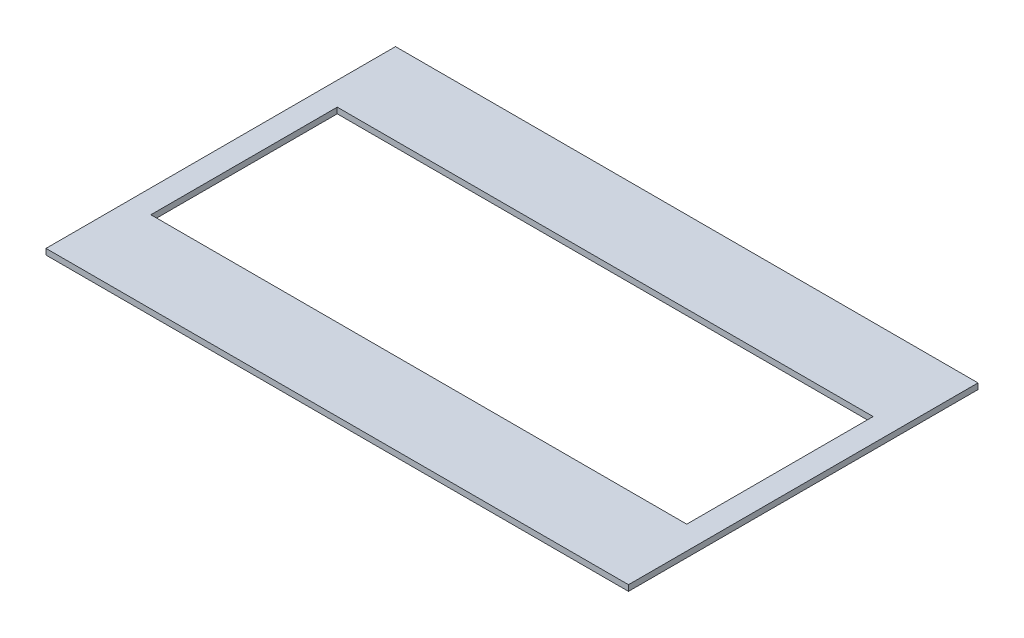
ISO-10303-21;
HEADER;
FILE_DESCRIPTION(('STEP AP214'),'2;1');
FILE_NAME('part.step','',(''),(''),'','','');
FILE_SCHEMA(('AUTOMOTIVE_DESIGN { 1 0 10303 214 1 1 1 1 }'));
ENDSEC;
DATA;
#1=APPLICATION_CONTEXT('core data for automotive mechanical design processes');
#2=APPLICATION_PROTOCOL_DEFINITION('international standard','automotive_design',2000,#1);
#3=PRODUCT_CONTEXT('',#1,'mechanical');
#4=PRODUCT('Part','Part','',(#3));
#5=PRODUCT_RELATED_PRODUCT_CATEGORY('part','',(#4));
#6=PRODUCT_DEFINITION_FORMATION('','',#4);
#7=PRODUCT_DEFINITION_CONTEXT('part definition',#1,'design');
#8=PRODUCT_DEFINITION('design','',#6,#7);
#9=PRODUCT_DEFINITION_SHAPE('','',#8);
#10=(LENGTH_UNIT() NAMED_UNIT(*) SI_UNIT(.MILLI.,.METRE.));
#11=(NAMED_UNIT(*) PLANE_ANGLE_UNIT() SI_UNIT($,.RADIAN.));
#12=(NAMED_UNIT(*) SI_UNIT($,.STERADIAN.) SOLID_ANGLE_UNIT());
#13=UNCERTAINTY_MEASURE_WITH_UNIT(LENGTH_MEASURE(1.E-05),#10,'distance_accuracy_value','');
#14=(GEOMETRIC_REPRESENTATION_CONTEXT(3) GLOBAL_UNCERTAINTY_ASSIGNED_CONTEXT((#13)) GLOBAL_UNIT_ASSIGNED_CONTEXT((#10,
#11,#12)) REPRESENTATION_CONTEXT('',''));
#15=CARTESIAN_POINT('',(0.,0.,0.));
#16=DIRECTION('',(0.,0.,1.));
#17=DIRECTION('',(1.,0.,0.));
#18=AXIS2_PLACEMENT_3D('',#15,#16,#17);
#19=CARTESIAN_POINT('',(-250.,5.,150.));
#20=DIRECTION('',(0.,0.,-1.));
#21=DIRECTION('',(-1.,0.,0.));
#22=AXIS2_PLACEMENT_3D('',#19,#20,#21);
#23=PLANE('',#22);
#24=DIRECTION('',(1.,0.,0.));
#25=VECTOR('',#24,1.);
#26=CARTESIAN_POINT('',(-250.,0.,150.));
#27=LINE('',#26,#25);
#28=CARTESIAN_POINT('',(-250.,0.,150.));
#29=VERTEX_POINT('',#28);
#30=CARTESIAN_POINT('',(250.,0.,150.));
#31=VERTEX_POINT('',#30);
#32=EDGE_CURVE('E133',#29,#31,#27,.T.);
#33=ORIENTED_EDGE('',*,*,#32,.T.);
#34=DIRECTION('',(0.,-1.,0.));
#35=VECTOR('',#34,1.);
#36=CARTESIAN_POINT('',(250.,5.,150.));
#37=LINE('',#36,#35);
#38=CARTESIAN_POINT('',(250.,5.,150.));
#39=VERTEX_POINT('',#38);
#40=EDGE_CURVE('E176',#39,#31,#37,.T.);
#41=ORIENTED_EDGE('',*,*,#40,.F.);
#42=DIRECTION('',(1.,0.,0.));
#43=VECTOR('',#42,1.);
#44=CARTESIAN_POINT('',(-250.,5.,150.));
#45=LINE('',#44,#43);
#46=CARTESIAN_POINT('',(-250.,5.,150.));
#47=VERTEX_POINT('',#46);
#48=EDGE_CURVE('E138',#47,#39,#45,.T.);
#49=ORIENTED_EDGE('',*,*,#48,.F.);
#50=DIRECTION('',(0.,-1.,0.));
#51=VECTOR('',#50,1.);
#52=CARTESIAN_POINT('',(-250.,5.,150.));
#53=LINE('',#52,#51);
#54=EDGE_CURVE('E153',#47,#29,#53,.T.);
#55=ORIENTED_EDGE('',*,*,#54,.T.);
#56=EDGE_LOOP('',(#33,#41,#49,#55));
#57=FACE_BOUND('',#56,.T.);
#58=ADVANCED_FACE('F38',(#57),#23,.F.);
#59=CARTESIAN_POINT('',(250.,5.,-150.));
#60=DIRECTION('',(1.,0.,0.));
#61=DIRECTION('',(0.,0.,-1.));
#62=AXIS2_PLACEMENT_3D('',#59,#60,#61);
#63=PLANE('',#62);
#64=DIRECTION('',(0.,0.,1.));
#65=VECTOR('',#64,1.);
#66=CARTESIAN_POINT('',(250.,0.,-150.));
#67=LINE('',#66,#65);
#68=CARTESIAN_POINT('',(250.,0.,-150.));
#69=VERTEX_POINT('',#68);
#70=EDGE_CURVE('E157',#69,#31,#67,.T.);
#71=ORIENTED_EDGE('',*,*,#70,.F.);
#72=DIRECTION('',(0.,-1.,0.));
#73=VECTOR('',#72,1.);
#74=CARTESIAN_POINT('',(250.,5.,-150.));
#75=LINE('',#74,#73);
#76=CARTESIAN_POINT('',(250.,5.,-150.));
#77=VERTEX_POINT('',#76);
#78=EDGE_CURVE('E173',#77,#69,#75,.T.);
#79=ORIENTED_EDGE('',*,*,#78,.F.);
#80=DIRECTION('',(0.,0.,1.));
#81=VECTOR('',#80,1.);
#82=CARTESIAN_POINT('',(250.,5.,-150.));
#83=LINE('',#82,#81);
#84=EDGE_CURVE('E141',#77,#39,#83,.T.);
#85=ORIENTED_EDGE('',*,*,#84,.T.);
#86=ORIENTED_EDGE('',*,*,#40,.T.);
#87=EDGE_LOOP('',(#71,#79,#85,#86));
#88=FACE_BOUND('',#87,.T.);
#89=ADVANCED_FACE('F206',(#88),#63,.T.);
#90=CARTESIAN_POINT('',(-250.,5.,-150.));
#91=DIRECTION('',(0.,0.,-1.));
#92=DIRECTION('',(-1.,0.,0.));
#93=AXIS2_PLACEMENT_3D('',#90,#91,#92);
#94=PLANE('',#93);
#95=DIRECTION('',(1.,0.,0.));
#96=VECTOR('',#95,1.);
#97=CARTESIAN_POINT('',(-250.,0.,-150.));
#98=LINE('',#97,#96);
#99=CARTESIAN_POINT('',(-250.,0.,-150.));
#100=VERTEX_POINT('',#99);
#101=EDGE_CURVE('E161',#100,#69,#98,.T.);
#102=ORIENTED_EDGE('',*,*,#101,.F.);
#103=DIRECTION('',(0.,-1.,0.));
#104=VECTOR('',#103,1.);
#105=CARTESIAN_POINT('',(-250.,5.,-150.));
#106=LINE('',#105,#104);
#107=CARTESIAN_POINT('',(-250.,5.,-150.));
#108=VERTEX_POINT('',#107);
#109=EDGE_CURVE('E170',#108,#100,#106,.T.);
#110=ORIENTED_EDGE('',*,*,#109,.F.);
#111=DIRECTION('',(1.,0.,0.));
#112=VECTOR('',#111,1.);
#113=CARTESIAN_POINT('',(-250.,5.,-150.));
#114=LINE('',#113,#112);
#115=EDGE_CURVE('E146',#108,#77,#114,.T.);
#116=ORIENTED_EDGE('',*,*,#115,.T.);
#117=ORIENTED_EDGE('',*,*,#78,.T.);
#118=EDGE_LOOP('',(#102,#110,#116,#117));
#119=FACE_BOUND('',#118,.T.);
#120=ADVANCED_FACE('F211',(#119),#94,.T.);
#121=CARTESIAN_POINT('',(-250.,5.,-150.));
#122=DIRECTION('',(1.,0.,0.));
#123=DIRECTION('',(0.,0.,-1.));
#124=AXIS2_PLACEMENT_3D('',#121,#122,#123);
#125=PLANE('',#124);
#126=DIRECTION('',(0.,0.,1.));
#127=VECTOR('',#126,1.);
#128=CARTESIAN_POINT('',(-250.,0.,-150.));
#129=LINE('',#128,#127);
#130=EDGE_CURVE('E142',#100,#29,#129,.T.);
#131=ORIENTED_EDGE('',*,*,#130,.T.);
#132=ORIENTED_EDGE('',*,*,#54,.F.);
#133=DIRECTION('',(0.,0.,1.));
#134=VECTOR('',#133,1.);
#135=CARTESIAN_POINT('',(-250.,5.,-150.));
#136=LINE('',#135,#134);
#137=EDGE_CURVE('E150',#108,#47,#136,.T.);
#138=ORIENTED_EDGE('',*,*,#137,.F.);
#139=ORIENTED_EDGE('',*,*,#109,.T.);
#140=EDGE_LOOP('',(#131,#132,#138,#139));
#141=FACE_BOUND('',#140,.T.);
#142=ADVANCED_FACE('F225',(#141),#125,.F.);
#143=CARTESIAN_POINT('',(0.,5.,0.));
#144=DIRECTION('',(0.,-1.,0.));
#145=DIRECTION('',(0.,0.,-1.));
#146=AXIS2_PLACEMENT_3D('',#143,#144,#145);
#147=PLANE('',#146);
#148=DIRECTION('',(-1.,0.,0.));
#149=VECTOR('',#148,1.);
#150=CARTESIAN_POINT('',(-230.,5.,-80.));
#151=LINE('',#150,#149);
#152=CARTESIAN_POINT('',(230.,5.,-80.));
#153=VERTEX_POINT('',#152);
#154=CARTESIAN_POINT('',(-230.,5.,-80.));
#155=VERTEX_POINT('',#154);
#156=EDGE_CURVE('E115',#153,#155,#151,.T.);
#157=ORIENTED_EDGE('',*,*,#156,.F.);
#158=DIRECTION('',(0.,0.,-1.));
#159=VECTOR('',#158,1.);
#160=CARTESIAN_POINT('',(230.,5.,-80.));
#161=LINE('',#160,#159);
#162=CARTESIAN_POINT('',(230.,5.,80.));
#163=VERTEX_POINT('',#162);
#164=EDGE_CURVE('E53',#163,#153,#161,.T.);
#165=ORIENTED_EDGE('',*,*,#164,.F.);
#166=DIRECTION('',(1.,0.,0.));
#167=VECTOR('',#166,1.);
#168=CARTESIAN_POINT('',(-230.,5.,80.));
#169=LINE('',#168,#167);
#170=CARTESIAN_POINT('',(-230.,5.,80.));
#171=VERTEX_POINT('',#170);
#172=EDGE_CURVE('E123',#171,#163,#169,.T.);
#173=ORIENTED_EDGE('',*,*,#172,.F.);
#174=DIRECTION('',(0.,0.,1.));
#175=VECTOR('',#174,1.);
#176=CARTESIAN_POINT('',(-230.,5.,-80.));
#177=LINE('',#176,#175);
#178=EDGE_CURVE('E105',#155,#171,#177,.T.);
#179=ORIENTED_EDGE('',*,*,#178,.F.);
#180=EDGE_LOOP('',(#157,#165,#173,#179));
#181=FACE_BOUND('',#180,.T.);
#182=ORIENTED_EDGE('',*,*,#48,.T.);
#183=ORIENTED_EDGE('',*,*,#84,.F.);
#184=ORIENTED_EDGE('',*,*,#115,.F.);
#185=ORIENTED_EDGE('',*,*,#137,.T.);
#186=EDGE_LOOP('',(#182,#183,#184,#185));
#187=FACE_BOUND('',#186,.T.);
#188=ADVANCED_FACE('F120',(#181,#187),#147,.F.);
#189=CARTESIAN_POINT('',(0.,0.,0.));
#190=DIRECTION('',(0.,-1.,0.));
#191=DIRECTION('',(0.,0.,-1.));
#192=AXIS2_PLACEMENT_3D('',#189,#190,#191);
#193=PLANE('',#192);
#194=DIRECTION('',(0.,0.,1.));
#195=VECTOR('',#194,1.);
#196=CARTESIAN_POINT('',(230.,0.,0.));
#197=LINE('',#196,#195);
#198=CARTESIAN_POINT('',(230.,0.,-80.));
#199=VERTEX_POINT('',#198);
#200=CARTESIAN_POINT('',(230.,0.,80.));
#201=VERTEX_POINT('',#200);
#202=EDGE_CURVE('E11',#199,#201,#197,.T.);
#203=ORIENTED_EDGE('',*,*,#202,.F.);
#204=DIRECTION('',(1.,0.,0.));
#205=VECTOR('',#204,1.);
#206=CARTESIAN_POINT('',(0.,0.,-80.));
#207=LINE('',#206,#205);
#208=CARTESIAN_POINT('',(-230.,0.,-80.));
#209=VERTEX_POINT('',#208);
#210=EDGE_CURVE('E179',#209,#199,#207,.T.);
#211=ORIENTED_EDGE('',*,*,#210,.F.);
#212=DIRECTION('',(0.,0.,-1.));
#213=VECTOR('',#212,1.);
#214=CARTESIAN_POINT('',(-230.,0.,0.));
#215=LINE('',#214,#213);
#216=CARTESIAN_POINT('',(-230.,0.,80.));
#217=VERTEX_POINT('',#216);
#218=EDGE_CURVE('E108',#217,#209,#215,.T.);
#219=ORIENTED_EDGE('',*,*,#218,.F.);
#220=DIRECTION('',(-1.,0.,0.));
#221=VECTOR('',#220,1.);
#222=CARTESIAN_POINT('',(0.,0.,80.));
#223=LINE('',#222,#221);
#224=EDGE_CURVE('E46',#201,#217,#223,.T.);
#225=ORIENTED_EDGE('',*,*,#224,.F.);
#226=EDGE_LOOP('',(#203,#211,#219,#225));
#227=FACE_BOUND('',#226,.T.);
#228=ORIENTED_EDGE('',*,*,#32,.F.);
#229=ORIENTED_EDGE('',*,*,#130,.F.);
#230=ORIENTED_EDGE('',*,*,#101,.T.);
#231=ORIENTED_EDGE('',*,*,#70,.T.);
#232=EDGE_LOOP('',(#228,#229,#230,#231));
#233=FACE_BOUND('',#232,.T.);
#234=ADVANCED_FACE('F190',(#227,#233),#193,.T.);
#235=CARTESIAN_POINT('',(230.,-5.,-80.));
#236=DIRECTION('',(1.,0.,0.));
#237=DIRECTION('',(0.,0.,-1.));
#238=AXIS2_PLACEMENT_3D('',#235,#236,#237);
#239=PLANE('',#238);
#240=ORIENTED_EDGE('',*,*,#202,.T.);
#241=DIRECTION('',(0.,1.,0.));
#242=VECTOR('',#241,1.);
#243=CARTESIAN_POINT('',(230.,-5.,80.));
#244=LINE('',#243,#242);
#245=EDGE_CURVE('E130',#201,#163,#244,.T.);
#246=ORIENTED_EDGE('',*,*,#245,.T.);
#247=ORIENTED_EDGE('',*,*,#164,.T.);
#248=DIRECTION('',(0.,1.,0.));
#249=VECTOR('',#248,1.);
#250=CARTESIAN_POINT('',(230.,-5.,-80.));
#251=LINE('',#250,#249);
#252=EDGE_CURVE('E112',#199,#153,#251,.T.);
#253=ORIENTED_EDGE('',*,*,#252,.F.);
#254=EDGE_LOOP('',(#240,#246,#247,#253));
#255=FACE_BOUND('',#254,.T.);
#256=ADVANCED_FACE('F192',(#255),#239,.F.);
#257=CARTESIAN_POINT('',(-230.,-5.,80.));
#258=DIRECTION('',(0.,0.,1.));
#259=DIRECTION('',(1.,0.,0.));
#260=AXIS2_PLACEMENT_3D('',#257,#258,#259);
#261=PLANE('',#260);
#262=ORIENTED_EDGE('',*,*,#224,.T.);
#263=DIRECTION('',(0.,1.,0.));
#264=VECTOR('',#263,1.);
#265=CARTESIAN_POINT('',(-230.,-5.,80.));
#266=LINE('',#265,#264);
#267=EDGE_CURVE('E111',#217,#171,#266,.T.);
#268=ORIENTED_EDGE('',*,*,#267,.T.);
#269=ORIENTED_EDGE('',*,*,#172,.T.);
#270=ORIENTED_EDGE('',*,*,#245,.F.);
#271=EDGE_LOOP('',(#262,#268,#269,#270));
#272=FACE_BOUND('',#271,.T.);
#273=ADVANCED_FACE('F187',(#272),#261,.F.);
#274=CARTESIAN_POINT('',(-230.,-5.,-80.));
#275=DIRECTION('',(-1.,0.,0.));
#276=DIRECTION('',(0.,0.,1.));
#277=AXIS2_PLACEMENT_3D('',#274,#275,#276);
#278=PLANE('',#277);
#279=ORIENTED_EDGE('',*,*,#218,.T.);
#280=DIRECTION('',(0.,1.,0.));
#281=VECTOR('',#280,1.);
#282=CARTESIAN_POINT('',(-230.,-5.,-80.));
#283=LINE('',#282,#281);
#284=EDGE_CURVE('E61',#209,#155,#283,.T.);
#285=ORIENTED_EDGE('',*,*,#284,.T.);
#286=ORIENTED_EDGE('',*,*,#178,.T.);
#287=ORIENTED_EDGE('',*,*,#267,.F.);
#288=EDGE_LOOP('',(#279,#285,#286,#287));
#289=FACE_BOUND('',#288,.T.);
#290=ADVANCED_FACE('F102',(#289),#278,.F.);
#291=CARTESIAN_POINT('',(-230.,-5.,-80.));
#292=DIRECTION('',(0.,0.,-1.));
#293=DIRECTION('',(-1.,0.,0.));
#294=AXIS2_PLACEMENT_3D('',#291,#292,#293);
#295=PLANE('',#294);
#296=ORIENTED_EDGE('',*,*,#210,.T.);
#297=ORIENTED_EDGE('',*,*,#252,.T.);
#298=ORIENTED_EDGE('',*,*,#156,.T.);
#299=ORIENTED_EDGE('',*,*,#284,.F.);
#300=EDGE_LOOP('',(#296,#297,#298,#299));
#301=FACE_BOUND('',#300,.T.);
#302=ADVANCED_FACE('F116',(#301),#295,.F.);
#303=CLOSED_SHELL('',(#58,#89,#120,#142,#188,#234,#256,#273,#290,#302));
#304=MANIFOLD_SOLID_BREP('B2',#303);
#305=ADVANCED_BREP_SHAPE_REPRESENTATION('',(#18,#304),#14);
#306=SHAPE_DEFINITION_REPRESENTATION(#9,#305);
ENDSEC;
END-ISO-10303-21;
